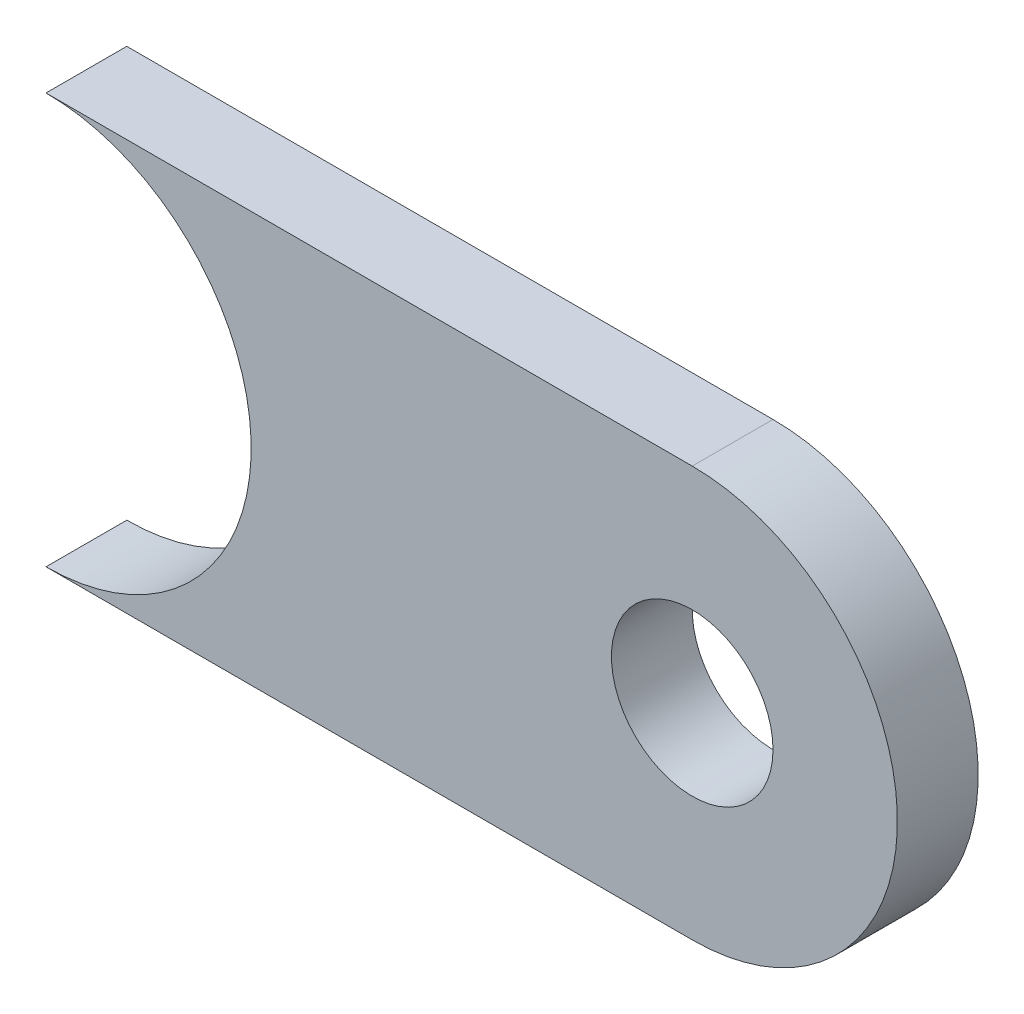
ISO-10303-21;
HEADER;
FILE_DESCRIPTION(('STEP AP214'),'2;1');
FILE_NAME('part.step','',(''),(''),'','','');
FILE_SCHEMA(('AUTOMOTIVE_DESIGN { 1 0 10303 214 1 1 1 1 }'));
ENDSEC;
DATA;
#1=APPLICATION_CONTEXT('core data for automotive mechanical design processes');
#2=APPLICATION_PROTOCOL_DEFINITION('international standard','automotive_design',2000,#1);
#3=PRODUCT_CONTEXT('',#1,'mechanical');
#4=PRODUCT('Part','Part','',(#3));
#5=PRODUCT_RELATED_PRODUCT_CATEGORY('part','',(#4));
#6=PRODUCT_DEFINITION_FORMATION('','',#4);
#7=PRODUCT_DEFINITION_CONTEXT('part definition',#1,'design');
#8=PRODUCT_DEFINITION('design','',#6,#7);
#9=PRODUCT_DEFINITION_SHAPE('','',#8);
#10=(LENGTH_UNIT() NAMED_UNIT(*) SI_UNIT(.MILLI.,.METRE.));
#11=(NAMED_UNIT(*) PLANE_ANGLE_UNIT() SI_UNIT($,.RADIAN.));
#12=(NAMED_UNIT(*) SI_UNIT($,.STERADIAN.) SOLID_ANGLE_UNIT());
#13=UNCERTAINTY_MEASURE_WITH_UNIT(LENGTH_MEASURE(1.E-05),#10,'distance_accuracy_value','');
#14=(GEOMETRIC_REPRESENTATION_CONTEXT(3) GLOBAL_UNCERTAINTY_ASSIGNED_CONTEXT((#13)) GLOBAL_UNIT_ASSIGNED_CONTEXT((#10,
#11,#12)) REPRESENTATION_CONTEXT('',''));
#15=CARTESIAN_POINT('',(0.,0.,0.));
#16=DIRECTION('',(0.,0.,1.));
#17=DIRECTION('',(1.,0.,0.));
#18=AXIS2_PLACEMENT_3D('',#15,#16,#17);
#19=CARTESIAN_POINT('',(0.,0.,5.));
#20=DIRECTION('',(0.,0.,1.));
#21=DIRECTION('',(1.,0.,0.));
#22=AXIS2_PLACEMENT_3D('',#19,#20,#21);
#23=PLANE('',#22);
#24=CARTESIAN_POINT('',(0.,0.,5.));
#25=DIRECTION('',(0.,0.,-1.));
#26=DIRECTION('',(1.,0.,0.));
#27=AXIS2_PLACEMENT_3D('',#24,#25,#26);
#28=CIRCLE('',#27,12.7);
#29=CARTESIAN_POINT('',(0.,12.7,5.));
#30=VERTEX_POINT('',#29);
#31=CARTESIAN_POINT('',(0.,-12.7,5.));
#32=VERTEX_POINT('',#31);
#33=EDGE_CURVE('E94',#30,#32,#28,.T.);
#34=ORIENTED_EDGE('',*,*,#33,.T.);
#35=DIRECTION('',(1.,0.,0.));
#36=VECTOR('',#35,1.);
#37=CARTESIAN_POINT('',(0.,-12.7,5.));
#38=LINE('',#37,#36);
#39=CARTESIAN_POINT('',(40.,-12.7,5.));
#40=VERTEX_POINT('',#39);
#41=EDGE_CURVE('E89',#32,#40,#38,.T.);
#42=ORIENTED_EDGE('',*,*,#41,.T.);
#43=CARTESIAN_POINT('',(40.,0.,5.));
#44=DIRECTION('',(0.,0.,1.));
#45=DIRECTION('',(1.,0.,0.));
#46=AXIS2_PLACEMENT_3D('',#43,#44,#45);
#47=CIRCLE('',#46,12.7);
#48=CARTESIAN_POINT('',(40.,12.7,5.));
#49=VERTEX_POINT('',#48);
#50=EDGE_CURVE('E92',#40,#49,#47,.T.);
#51=ORIENTED_EDGE('',*,*,#50,.T.);
#52=DIRECTION('',(-1.,0.,0.));
#53=VECTOR('',#52,1.);
#54=CARTESIAN_POINT('',(0.,12.7,5.));
#55=LINE('',#54,#53);
#56=EDGE_CURVE('E59',#49,#30,#55,.T.);
#57=ORIENTED_EDGE('',*,*,#56,.T.);
#58=EDGE_LOOP('',(#34,#42,#51,#57));
#59=FACE_BOUND('',#58,.T.);
#60=CARTESIAN_POINT('',(40.,0.,5.));
#61=DIRECTION('',(0.,0.,1.));
#62=DIRECTION('',(1.,0.,0.));
#63=AXIS2_PLACEMENT_3D('',#60,#61,#62);
#64=CIRCLE('',#63,5.);
#65=CARTESIAN_POINT('',(45.,0.,5.));
#66=VERTEX_POINT('',#65);
#67=EDGE_CURVE('E114',#66,#66,#64,.T.);
#68=ORIENTED_EDGE('',*,*,#67,.F.);
#69=EDGE_LOOP('',(#68));
#70=FACE_BOUND('',#69,.T.);
#71=ADVANCED_FACE('F41',(#59,#70),#23,.T.);
#72=CARTESIAN_POINT('',(0.,0.,0.));
#73=DIRECTION('',(0.,0.,1.));
#74=DIRECTION('',(1.,0.,0.));
#75=AXIS2_PLACEMENT_3D('',#72,#73,#74);
#76=PLANE('',#75);
#77=CARTESIAN_POINT('',(0.,0.,0.));
#78=DIRECTION('',(0.,0.,-1.));
#79=DIRECTION('',(1.,0.,0.));
#80=AXIS2_PLACEMENT_3D('',#77,#78,#79);
#81=CIRCLE('',#80,12.7);
#82=CARTESIAN_POINT('',(0.,12.7,0.));
#83=VERTEX_POINT('',#82);
#84=CARTESIAN_POINT('',(0.,-12.7,0.));
#85=VERTEX_POINT('',#84);
#86=EDGE_CURVE('E110',#83,#85,#81,.T.);
#87=ORIENTED_EDGE('',*,*,#86,.F.);
#88=DIRECTION('',(-1.,0.,0.));
#89=VECTOR('',#88,1.);
#90=CARTESIAN_POINT('',(0.,12.7,0.));
#91=LINE('',#90,#89);
#92=CARTESIAN_POINT('',(40.,12.7,0.));
#93=VERTEX_POINT('',#92);
#94=EDGE_CURVE('E82',#93,#83,#91,.T.);
#95=ORIENTED_EDGE('',*,*,#94,.F.);
#96=CARTESIAN_POINT('',(40.,0.,0.));
#97=DIRECTION('',(0.,0.,1.));
#98=DIRECTION('',(1.,0.,0.));
#99=AXIS2_PLACEMENT_3D('',#96,#97,#98);
#100=CIRCLE('',#99,12.7);
#101=CARTESIAN_POINT('',(40.,-12.7,0.));
#102=VERTEX_POINT('',#101);
#103=EDGE_CURVE('E76',#102,#93,#100,.T.);
#104=ORIENTED_EDGE('',*,*,#103,.F.);
#105=DIRECTION('',(1.,0.,0.));
#106=VECTOR('',#105,1.);
#107=CARTESIAN_POINT('',(0.,-12.7,0.));
#108=LINE('',#107,#106);
#109=EDGE_CURVE('E99',#85,#102,#108,.T.);
#110=ORIENTED_EDGE('',*,*,#109,.F.);
#111=EDGE_LOOP('',(#87,#95,#104,#110));
#112=FACE_BOUND('',#111,.T.);
#113=CARTESIAN_POINT('',(40.,0.,0.));
#114=DIRECTION('',(0.,0.,1.));
#115=DIRECTION('',(1.,0.,0.));
#116=AXIS2_PLACEMENT_3D('',#113,#114,#115);
#117=CIRCLE('',#116,5.);
#118=CARTESIAN_POINT('',(45.,0.,0.));
#119=VERTEX_POINT('',#118);
#120=EDGE_CURVE('E132',#119,#119,#117,.T.);
#121=ORIENTED_EDGE('',*,*,#120,.T.);
#122=EDGE_LOOP('',(#121));
#123=FACE_BOUND('',#122,.T.);
#124=ADVANCED_FACE('F127',(#112,#123),#76,.F.);
#125=CARTESIAN_POINT('',(0.,0.,5.));
#126=DIRECTION('',(0.,0.,-1.));
#127=DIRECTION('',(-1.,0.,0.));
#128=AXIS2_PLACEMENT_3D('',#125,#126,#127);
#129=CYLINDRICAL_SURFACE('',#128,12.7);
#130=ORIENTED_EDGE('',*,*,#86,.T.);
#131=DIRECTION('',(0.,0.,-1.));
#132=VECTOR('',#131,1.);
#133=CARTESIAN_POINT('',(0.,-12.7,5.));
#134=LINE('',#133,#132);
#135=EDGE_CURVE('E11',#32,#85,#134,.T.);
#136=ORIENTED_EDGE('',*,*,#135,.F.);
#137=ORIENTED_EDGE('',*,*,#33,.F.);
#138=DIRECTION('',(0.,0.,-1.));
#139=VECTOR('',#138,1.);
#140=CARTESIAN_POINT('',(0.,12.7,5.));
#141=LINE('',#140,#139);
#142=EDGE_CURVE('E106',#30,#83,#141,.T.);
#143=ORIENTED_EDGE('',*,*,#142,.T.);
#144=EDGE_LOOP('',(#130,#136,#137,#143));
#145=FACE_BOUND('',#144,.T.);
#146=ADVANCED_FACE('F43',(#145),#129,.F.);
#147=CARTESIAN_POINT('',(0.,-12.7,5.));
#148=DIRECTION('',(0.,1.,0.));
#149=DIRECTION('',(0.,0.,1.));
#150=AXIS2_PLACEMENT_3D('',#147,#148,#149);
#151=PLANE('',#150);
#152=ORIENTED_EDGE('',*,*,#109,.T.);
#153=DIRECTION('',(0.,0.,-1.));
#154=VECTOR('',#153,1.);
#155=CARTESIAN_POINT('',(40.,-12.7,5.));
#156=LINE('',#155,#154);
#157=EDGE_CURVE('E51',#40,#102,#156,.T.);
#158=ORIENTED_EDGE('',*,*,#157,.F.);
#159=ORIENTED_EDGE('',*,*,#41,.F.);
#160=ORIENTED_EDGE('',*,*,#135,.T.);
#161=EDGE_LOOP('',(#152,#158,#159,#160));
#162=FACE_BOUND('',#161,.T.);
#163=ADVANCED_FACE('F98',(#162),#151,.F.);
#164=CARTESIAN_POINT('',(40.,0.,5.));
#165=DIRECTION('',(0.,0.,-1.));
#166=DIRECTION('',(-1.,0.,0.));
#167=AXIS2_PLACEMENT_3D('',#164,#165,#166);
#168=CYLINDRICAL_SURFACE('',#167,12.7);
#169=ORIENTED_EDGE('',*,*,#103,.T.);
#170=DIRECTION('',(0.,0.,-1.));
#171=VECTOR('',#170,1.);
#172=CARTESIAN_POINT('',(40.,12.7,5.));
#173=LINE('',#172,#171);
#174=EDGE_CURVE('E101',#49,#93,#173,.T.);
#175=ORIENTED_EDGE('',*,*,#174,.F.);
#176=ORIENTED_EDGE('',*,*,#50,.F.);
#177=ORIENTED_EDGE('',*,*,#157,.T.);
#178=EDGE_LOOP('',(#169,#175,#176,#177));
#179=FACE_BOUND('',#178,.T.);
#180=ADVANCED_FACE('F102',(#179),#168,.T.);
#181=CARTESIAN_POINT('',(0.,12.7,5.));
#182=DIRECTION('',(0.,-1.,0.));
#183=DIRECTION('',(0.,0.,-1.));
#184=AXIS2_PLACEMENT_3D('',#181,#182,#183);
#185=PLANE('',#184);
#186=ORIENTED_EDGE('',*,*,#94,.T.);
#187=ORIENTED_EDGE('',*,*,#142,.F.);
#188=ORIENTED_EDGE('',*,*,#56,.F.);
#189=ORIENTED_EDGE('',*,*,#174,.T.);
#190=EDGE_LOOP('',(#186,#187,#188,#189));
#191=FACE_BOUND('',#190,.T.);
#192=ADVANCED_FACE('F124',(#191),#185,.F.);
#193=CARTESIAN_POINT('',(40.,0.,5.));
#194=DIRECTION('',(0.,0.,-1.));
#195=DIRECTION('',(-1.,0.,0.));
#196=AXIS2_PLACEMENT_3D('',#193,#194,#195);
#197=CYLINDRICAL_SURFACE('',#196,5.);
#198=ORIENTED_EDGE('',*,*,#67,.T.);
#199=EDGE_LOOP('',(#198));
#200=FACE_BOUND('',#199,.T.);
#201=ORIENTED_EDGE('',*,*,#120,.F.);
#202=EDGE_LOOP('',(#201));
#203=FACE_BOUND('',#202,.T.);
#204=ADVANCED_FACE('F140',(#200,#203),#197,.F.);
#205=CLOSED_SHELL('',(#71,#124,#146,#163,#180,#192,#204));
#206=MANIFOLD_SOLID_BREP('B2',#205);
#207=ADVANCED_BREP_SHAPE_REPRESENTATION('',(#18,#206),#14);
#208=SHAPE_DEFINITION_REPRESENTATION(#9,#207);
ENDSEC;
END-ISO-10303-21;
